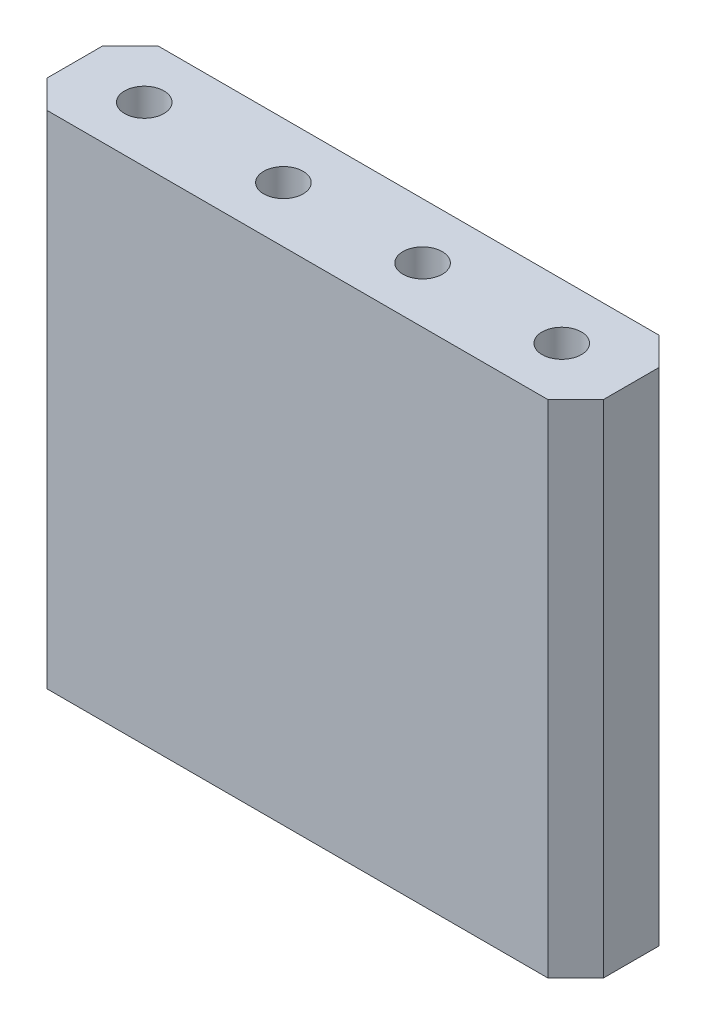
ISO-10303-21;
HEADER;
FILE_DESCRIPTION(('STEP AP214'),'2;1');
FILE_NAME('part.step','',(''),(''),'','','');
FILE_SCHEMA(('AUTOMOTIVE_DESIGN { 1 0 10303 214 1 1 1 1 }'));
ENDSEC;
DATA;
#1=APPLICATION_CONTEXT('core data for automotive mechanical design processes');
#2=APPLICATION_PROTOCOL_DEFINITION('international standard','automotive_design',2000,#1);
#3=PRODUCT_CONTEXT('',#1,'mechanical');
#4=PRODUCT('Part','Part','',(#3));
#5=PRODUCT_RELATED_PRODUCT_CATEGORY('part','',(#4));
#6=PRODUCT_DEFINITION_FORMATION('','',#4);
#7=PRODUCT_DEFINITION_CONTEXT('part definition',#1,'design');
#8=PRODUCT_DEFINITION('design','',#6,#7);
#9=PRODUCT_DEFINITION_SHAPE('','',#8);
#10=(LENGTH_UNIT() NAMED_UNIT(*) SI_UNIT(.MILLI.,.METRE.));
#11=(NAMED_UNIT(*) PLANE_ANGLE_UNIT() SI_UNIT($,.RADIAN.));
#12=(NAMED_UNIT(*) SI_UNIT($,.STERADIAN.) SOLID_ANGLE_UNIT());
#13=UNCERTAINTY_MEASURE_WITH_UNIT(LENGTH_MEASURE(1.E-05),#10,'distance_accuracy_value','');
#14=(GEOMETRIC_REPRESENTATION_CONTEXT(3) GLOBAL_UNCERTAINTY_ASSIGNED_CONTEXT((#13)) GLOBAL_UNIT_ASSIGNED_CONTEXT((#10,
#11,#12)) REPRESENTATION_CONTEXT('',''));
#15=CARTESIAN_POINT('',(0.,0.,0.));
#16=DIRECTION('',(0.,0.,1.));
#17=DIRECTION('',(1.,0.,0.));
#18=AXIS2_PLACEMENT_3D('',#15,#16,#17);
#19=CARTESIAN_POINT('',(0.,7.,0.));
#20=DIRECTION('',(0.,-1.,0.));
#21=DIRECTION('',(0.,0.,-1.));
#22=AXIS2_PLACEMENT_3D('',#19,#20,#21);
#23=PLANE('',#22);
#24=DIRECTION('',(0.,0.,-1.));
#25=VECTOR('',#24,1.);
#26=CARTESIAN_POINT('',(1.5,7.,-0.25));
#27=LINE('',#26,#25);
#28=CARTESIAN_POINT('',(1.5,7.,0.25));
#29=VERTEX_POINT('',#28);
#30=CARTESIAN_POINT('',(1.5,7.,-0.25));
#31=VERTEX_POINT('',#30);
#32=EDGE_CURVE('E212',#29,#31,#27,.T.);
#33=ORIENTED_EDGE('',*,*,#32,.F.);
#34=CARTESIAN_POINT('',(1.25,7.,0.));
#35=DIRECTION('',(0.,1.,0.));
#36=DIRECTION('',(0.,0.,1.));
#37=AXIS2_PLACEMENT_3D('',#34,#35,#36);
#38=CIRCLE('',#37,0.353553390593274);
#39=EDGE_CURVE('E200',#29,#31,#38,.T.);
#40=ORIENTED_EDGE('',*,*,#39,.T.);
#41=EDGE_LOOP('',(#33,#40));
#42=FACE_BOUND('',#41,.T.);
#43=ADVANCED_FACE('F35',(#42),#23,.F.);
#44=DIRECTION('',(-1.,0.,0.));
#45=VECTOR('',#44,1.);
#46=CARTESIAN_POINT('',(0.999999999999999,7.,-0.25));
#47=LINE('',#46,#45);
#48=CARTESIAN_POINT('',(0.999999999999999,7.,-0.25));
#49=VERTEX_POINT('',#48);
#50=EDGE_CURVE('E231',#31,#49,#47,.T.);
#51=ORIENTED_EDGE('',*,*,#50,.F.);
#52=EDGE_CURVE('E197',#31,#49,#38,.T.);
#53=ORIENTED_EDGE('',*,*,#52,.T.);
#54=EDGE_LOOP('',(#51,#53));
#55=FACE_BOUND('',#54,.T.);
#56=ADVANCED_FACE('F236',(#55),#23,.F.);
#57=DIRECTION('',(0.,0.,1.));
#58=VECTOR('',#57,1.);
#59=CARTESIAN_POINT('',(0.999999999999999,7.,-0.25));
#60=LINE('',#59,#58);
#61=CARTESIAN_POINT('',(0.999999999999999,7.,0.25));
#62=VERTEX_POINT('',#61);
#63=EDGE_CURVE('E237',#49,#62,#60,.T.);
#64=ORIENTED_EDGE('',*,*,#63,.F.);
#65=EDGE_CURVE('E203',#49,#62,#38,.T.);
#66=ORIENTED_EDGE('',*,*,#65,.T.);
#67=EDGE_LOOP('',(#64,#66));
#68=FACE_BOUND('',#67,.T.);
#69=ADVANCED_FACE('F482',(#68),#23,.F.);
#70=DIRECTION('',(1.,0.,0.));
#71=VECTOR('',#70,1.);
#72=CARTESIAN_POINT('',(0.999999999999999,7.,0.25));
#73=LINE('',#72,#71);
#74=EDGE_CURVE('E226',#62,#29,#73,.T.);
#75=ORIENTED_EDGE('',*,*,#74,.F.);
#76=EDGE_CURVE('E215',#62,#29,#38,.T.);
#77=ORIENTED_EDGE('',*,*,#76,.T.);
#78=EDGE_LOOP('',(#75,#77));
#79=FACE_BOUND('',#78,.T.);
#80=ADVANCED_FACE('F531',(#79),#23,.F.);
#81=DIRECTION('',(0.,0.,-1.));
#82=VECTOR('',#81,1.);
#83=CARTESIAN_POINT('',(-3.5,7.,-0.25));
#84=LINE('',#83,#82);
#85=CARTESIAN_POINT('',(-3.5,7.,0.25));
#86=VERTEX_POINT('',#85);
#87=CARTESIAN_POINT('',(-3.5,7.,-0.25));
#88=VERTEX_POINT('',#87);
#89=EDGE_CURVE('E298',#86,#88,#84,.T.);
#90=ORIENTED_EDGE('',*,*,#89,.F.);
#91=CARTESIAN_POINT('',(-3.75,7.,0.));
#92=DIRECTION('',(0.,1.,0.));
#93=DIRECTION('',(0.,0.,1.));
#94=AXIS2_PLACEMENT_3D('',#91,#92,#93);
#95=CIRCLE('',#94,0.353553390593274);
#96=EDGE_CURVE('E437',#86,#88,#95,.T.);
#97=ORIENTED_EDGE('',*,*,#96,.T.);
#98=EDGE_LOOP('',(#90,#97));
#99=FACE_BOUND('',#98,.T.);
#100=ADVANCED_FACE('F857',(#99),#23,.F.);
#101=DIRECTION('',(-1.,0.,0.));
#102=VECTOR('',#101,1.);
#103=CARTESIAN_POINT('',(-4.,7.,-0.25));
#104=LINE('',#103,#102);
#105=CARTESIAN_POINT('',(-4.,7.,-0.25));
#106=VERTEX_POINT('',#105);
#107=EDGE_CURVE('E302',#88,#106,#104,.T.);
#108=ORIENTED_EDGE('',*,*,#107,.F.);
#109=EDGE_CURVE('E441',#88,#106,#95,.T.);
#110=ORIENTED_EDGE('',*,*,#109,.T.);
#111=EDGE_LOOP('',(#108,#110));
#112=FACE_BOUND('',#111,.T.);
#113=ADVANCED_FACE('F849',(#112),#23,.F.);
#114=DIRECTION('',(0.,0.,1.));
#115=VECTOR('',#114,1.);
#116=CARTESIAN_POINT('',(-4.,7.,0.25));
#117=LINE('',#116,#115);
#118=CARTESIAN_POINT('',(-4.,7.,0.25));
#119=VERTEX_POINT('',#118);
#120=EDGE_CURVE('E305',#106,#119,#117,.T.);
#121=ORIENTED_EDGE('',*,*,#120,.F.);
#122=EDGE_CURVE('E533',#106,#119,#95,.T.);
#123=ORIENTED_EDGE('',*,*,#122,.T.);
#124=EDGE_LOOP('',(#121,#123));
#125=FACE_BOUND('',#124,.T.);
#126=ADVANCED_FACE('F580',(#125),#23,.F.);
#127=DIRECTION('',(1.,0.,0.));
#128=VECTOR('',#127,1.);
#129=CARTESIAN_POINT('',(-3.5,7.,0.25));
#130=LINE('',#129,#128);
#131=EDGE_CURVE('E295',#119,#86,#130,.T.);
#132=ORIENTED_EDGE('',*,*,#131,.F.);
#133=EDGE_CURVE('E442',#119,#86,#95,.T.);
#134=ORIENTED_EDGE('',*,*,#133,.T.);
#135=EDGE_LOOP('',(#132,#134));
#136=FACE_BOUND('',#135,.T.);
#137=ADVANCED_FACE('F575',(#136),#23,.F.);
#138=DIRECTION('',(0.,0.,-1.));
#139=VECTOR('',#138,1.);
#140=CARTESIAN_POINT('',(-1.,7.,-0.25));
#141=LINE('',#140,#139);
#142=CARTESIAN_POINT('',(-1.,7.,0.25));
#143=VERTEX_POINT('',#142);
#144=CARTESIAN_POINT('',(-1.,7.,-0.25));
#145=VERTEX_POINT('',#144);
#146=EDGE_CURVE('E271',#143,#145,#141,.T.);
#147=ORIENTED_EDGE('',*,*,#146,.F.);
#148=CARTESIAN_POINT('',(-1.25,7.,0.));
#149=DIRECTION('',(0.,1.,0.));
#150=DIRECTION('',(0.,0.,1.));
#151=AXIS2_PLACEMENT_3D('',#148,#149,#150);
#152=CIRCLE('',#151,0.353553390593274);
#153=EDGE_CURVE('E445',#143,#145,#152,.T.);
#154=ORIENTED_EDGE('',*,*,#153,.T.);
#155=EDGE_LOOP('',(#147,#154));
#156=FACE_BOUND('',#155,.T.);
#157=ADVANCED_FACE('F570',(#156),#23,.F.);
#158=DIRECTION('',(-1.,0.,0.));
#159=VECTOR('',#158,1.);
#160=CARTESIAN_POINT('',(-1.5,7.,-0.25));
#161=LINE('',#160,#159);
#162=CARTESIAN_POINT('',(-1.5,7.,-0.25));
#163=VERTEX_POINT('',#162);
#164=EDGE_CURVE('E261',#145,#163,#161,.T.);
#165=ORIENTED_EDGE('',*,*,#164,.F.);
#166=EDGE_CURVE('E448',#145,#163,#152,.T.);
#167=ORIENTED_EDGE('',*,*,#166,.T.);
#168=EDGE_LOOP('',(#165,#167));
#169=FACE_BOUND('',#168,.T.);
#170=ADVANCED_FACE('F568',(#169),#23,.F.);
#171=DIRECTION('',(0.,0.,1.));
#172=VECTOR('',#171,1.);
#173=CARTESIAN_POINT('',(-1.5,7.,-0.25));
#174=LINE('',#173,#172);
#175=CARTESIAN_POINT('',(-1.5,7.,0.25));
#176=VERTEX_POINT('',#175);
#177=EDGE_CURVE('E264',#163,#176,#174,.T.);
#178=ORIENTED_EDGE('',*,*,#177,.F.);
#179=EDGE_CURVE('E516',#163,#176,#152,.T.);
#180=ORIENTED_EDGE('',*,*,#179,.T.);
#181=EDGE_LOOP('',(#178,#180));
#182=FACE_BOUND('',#181,.T.);
#183=ADVANCED_FACE('F549',(#182),#23,.F.);
#184=DIRECTION('',(1.,0.,0.));
#185=VECTOR('',#184,1.);
#186=CARTESIAN_POINT('',(-1.,7.,0.25));
#187=LINE('',#186,#185);
#188=EDGE_CURVE('E268',#176,#143,#187,.T.);
#189=ORIENTED_EDGE('',*,*,#188,.F.);
#190=EDGE_CURVE('E449',#176,#143,#152,.T.);
#191=ORIENTED_EDGE('',*,*,#190,.T.);
#192=EDGE_LOOP('',(#189,#191));
#193=FACE_BOUND('',#192,.T.);
#194=ADVANCED_FACE('F561',(#193),#23,.F.);
#195=DIRECTION('',(0.,0.,-1.));
#196=VECTOR('',#195,1.);
#197=CARTESIAN_POINT('',(4.,7.,0.25));
#198=LINE('',#197,#196);
#199=CARTESIAN_POINT('',(4.,7.,0.25));
#200=VERTEX_POINT('',#199);
#201=CARTESIAN_POINT('',(4.,7.,-0.25));
#202=VERTEX_POINT('',#201);
#203=EDGE_CURVE('E339',#200,#202,#198,.T.);
#204=ORIENTED_EDGE('',*,*,#203,.F.);
#205=CARTESIAN_POINT('',(3.75,7.,0.));
#206=DIRECTION('',(0.,1.,0.));
#207=DIRECTION('',(0.,0.,1.));
#208=AXIS2_PLACEMENT_3D('',#205,#206,#207);
#209=CIRCLE('',#208,0.353553390593274);
#210=EDGE_CURVE('E454',#200,#202,#209,.T.);
#211=ORIENTED_EDGE('',*,*,#210,.T.);
#212=EDGE_LOOP('',(#204,#211));
#213=FACE_BOUND('',#212,.T.);
#214=ADVANCED_FACE('F504',(#213),#23,.F.);
#215=DIRECTION('',(-1.,0.,0.));
#216=VECTOR('',#215,1.);
#217=CARTESIAN_POINT('',(3.5,7.,-0.25));
#218=LINE('',#217,#216);
#219=CARTESIAN_POINT('',(3.5,7.,-0.25));
#220=VERTEX_POINT('',#219);
#221=EDGE_CURVE('E329',#202,#220,#218,.T.);
#222=ORIENTED_EDGE('',*,*,#221,.F.);
#223=EDGE_CURVE('E457',#202,#220,#209,.T.);
#224=ORIENTED_EDGE('',*,*,#223,.T.);
#225=EDGE_LOOP('',(#222,#224));
#226=FACE_BOUND('',#225,.T.);
#227=ADVANCED_FACE('F492',(#226),#23,.F.);
#228=DIRECTION('',(0.,0.,1.));
#229=VECTOR('',#228,1.);
#230=CARTESIAN_POINT('',(3.5,7.,-0.25));
#231=LINE('',#230,#229);
#232=CARTESIAN_POINT('',(3.5,7.,0.25));
#233=VERTEX_POINT('',#232);
#234=EDGE_CURVE('E332',#220,#233,#231,.T.);
#235=ORIENTED_EDGE('',*,*,#234,.F.);
#236=EDGE_CURVE('E514',#220,#233,#209,.T.);
#237=ORIENTED_EDGE('',*,*,#236,.T.);
#238=EDGE_LOOP('',(#235,#237));
#239=FACE_BOUND('',#238,.T.);
#240=ADVANCED_FACE('F486',(#239),#23,.F.);
#241=DIRECTION('',(1.,0.,0.));
#242=VECTOR('',#241,1.);
#243=CARTESIAN_POINT('',(3.5,7.,0.25));
#244=LINE('',#243,#242);
#245=EDGE_CURVE('E336',#233,#200,#244,.T.);
#246=ORIENTED_EDGE('',*,*,#245,.F.);
#247=EDGE_CURVE('E373',#233,#200,#209,.T.);
#248=ORIENTED_EDGE('',*,*,#247,.T.);
#249=EDGE_LOOP('',(#246,#248));
#250=FACE_BOUND('',#249,.T.);
#251=ADVANCED_FACE('F478',(#250),#23,.F.);
#252=CARTESIAN_POINT('',(0.,0.,0.));
#253=DIRECTION('',(0.,-1.,0.));
#254=DIRECTION('',(0.,0.,-1.));
#255=AXIS2_PLACEMENT_3D('',#252,#253,#254);
#256=PLANE('',#255);
#257=DIRECTION('',(1.,0.,0.));
#258=VECTOR('',#257,1.);
#259=CARTESIAN_POINT('',(-5.,0.,1.));
#260=LINE('',#259,#258);
#261=CARTESIAN_POINT('',(-4.5,0.,1.));
#262=VERTEX_POINT('',#261);
#263=CARTESIAN_POINT('',(4.5,0.,1.));
#264=VERTEX_POINT('',#263);
#265=EDGE_CURVE('E370',#262,#264,#260,.T.);
#266=ORIENTED_EDGE('',*,*,#265,.F.);
#267=DIRECTION('',(0.707106781186546,0.,0.707106781186549));
#268=VECTOR('',#267,1.);
#269=CARTESIAN_POINT('',(-2.75000000000001,0.,2.75));
#270=LINE('',#269,#268);
#271=CARTESIAN_POINT('',(-5.,0.,0.499999999999999));
#272=VERTEX_POINT('',#271);
#273=EDGE_CURVE('E384',#262,#272,#270,.F.);
#274=ORIENTED_EDGE('',*,*,#273,.T.);
#275=DIRECTION('',(0.,0.,1.));
#276=VECTOR('',#275,1.);
#277=CARTESIAN_POINT('',(-5.,0.,1.));
#278=LINE('',#277,#276);
#279=CARTESIAN_POINT('',(-5.,0.,-0.5));
#280=VERTEX_POINT('',#279);
#281=EDGE_CURVE('E367',#280,#272,#278,.T.);
#282=ORIENTED_EDGE('',*,*,#281,.F.);
#283=DIRECTION('',(-0.707106781186549,0.,0.707106781186546));
#284=VECTOR('',#283,1.);
#285=CARTESIAN_POINT('',(-2.74999999999999,0.,-2.75));
#286=LINE('',#285,#284);
#287=CARTESIAN_POINT('',(-4.5,0.,-1.));
#288=VERTEX_POINT('',#287);
#289=EDGE_CURVE('E382',#280,#288,#286,.F.);
#290=ORIENTED_EDGE('',*,*,#289,.T.);
#291=DIRECTION('',(-1.,0.,0.));
#292=VECTOR('',#291,1.);
#293=CARTESIAN_POINT('',(-5.,0.,-1.));
#294=LINE('',#293,#292);
#295=CARTESIAN_POINT('',(4.5,0.,-1.));
#296=VERTEX_POINT('',#295);
#297=EDGE_CURVE('E365',#296,#288,#294,.T.);
#298=ORIENTED_EDGE('',*,*,#297,.F.);
#299=DIRECTION('',(-0.707106781186546,0.,-0.707106781186549));
#300=VECTOR('',#299,1.);
#301=CARTESIAN_POINT('',(2.75000000000001,0.,-2.75));
#302=LINE('',#301,#300);
#303=CARTESIAN_POINT('',(5.,0.,-0.499999999999998));
#304=VERTEX_POINT('',#303);
#305=EDGE_CURVE('E378',#296,#304,#302,.F.);
#306=ORIENTED_EDGE('',*,*,#305,.T.);
#307=DIRECTION('',(0.,0.,-1.));
#308=VECTOR('',#307,1.);
#309=CARTESIAN_POINT('',(5.,0.,1.));
#310=LINE('',#309,#308);
#311=CARTESIAN_POINT('',(5.,0.,0.499999999999999));
#312=VERTEX_POINT('',#311);
#313=EDGE_CURVE('E362',#312,#304,#310,.T.);
#314=ORIENTED_EDGE('',*,*,#313,.F.);
#315=DIRECTION('',(0.707106781186549,0.,-0.707106781186546));
#316=VECTOR('',#315,1.);
#317=CARTESIAN_POINT('',(2.74999999999999,0.,2.75));
#318=LINE('',#317,#316);
#319=EDGE_CURVE('E380',#312,#264,#318,.F.);
#320=ORIENTED_EDGE('',*,*,#319,.T.);
#321=EDGE_LOOP('',(#266,#274,#282,#290,#298,#306,#314,#320));
#322=FACE_BOUND('',#321,.T.);
#323=DIRECTION('',(0.,0.,-1.));
#324=VECTOR('',#323,1.);
#325=CARTESIAN_POINT('',(4.,0.,0.25));
#326=LINE('',#325,#324);
#327=CARTESIAN_POINT('',(4.,0.,0.25));
#328=VERTEX_POINT('',#327);
#329=CARTESIAN_POINT('',(4.,0.,-0.25));
#330=VERTEX_POINT('',#329);
#331=EDGE_CURVE('E333',#328,#330,#326,.T.);
#332=ORIENTED_EDGE('',*,*,#331,.T.);
#333=DIRECTION('',(-1.,0.,0.));
#334=VECTOR('',#333,1.);
#335=CARTESIAN_POINT('',(3.5,0.,-0.25));
#336=LINE('',#335,#334);
#337=CARTESIAN_POINT('',(3.5,0.,-0.25));
#338=VERTEX_POINT('',#337);
#339=EDGE_CURVE('E328',#330,#338,#336,.T.);
#340=ORIENTED_EDGE('',*,*,#339,.T.);
#341=DIRECTION('',(0.,0.,1.));
#342=VECTOR('',#341,1.);
#343=CARTESIAN_POINT('',(3.5,0.,-0.25));
#344=LINE('',#343,#342);
#345=CARTESIAN_POINT('',(3.5,0.,0.25));
#346=VERTEX_POINT('',#345);
#347=EDGE_CURVE('E345',#338,#346,#344,.T.);
#348=ORIENTED_EDGE('',*,*,#347,.T.);
#349=DIRECTION('',(1.,0.,0.));
#350=VECTOR('',#349,1.);
#351=CARTESIAN_POINT('',(3.5,0.,0.25));
#352=LINE('',#351,#350);
#353=EDGE_CURVE('E348',#346,#328,#352,.T.);
#354=ORIENTED_EDGE('',*,*,#353,.T.);
#355=EDGE_LOOP('',(#332,#340,#348,#354));
#356=FACE_BOUND('',#355,.T.);
#357=DIRECTION('',(0.,0.,1.));
#358=VECTOR('',#357,1.);
#359=CARTESIAN_POINT('',(-4.,0.,0.25));
#360=LINE('',#359,#358);
#361=CARTESIAN_POINT('',(-4.,0.,-0.25));
#362=VERTEX_POINT('',#361);
#363=CARTESIAN_POINT('',(-4.,0.,0.25));
#364=VERTEX_POINT('',#363);
#365=EDGE_CURVE('E299',#362,#364,#360,.T.);
#366=ORIENTED_EDGE('',*,*,#365,.T.);
#367=DIRECTION('',(1.,0.,0.));
#368=VECTOR('',#367,1.);
#369=CARTESIAN_POINT('',(-3.5,0.,0.25));
#370=LINE('',#369,#368);
#371=CARTESIAN_POINT('',(-3.5,0.,0.25));
#372=VERTEX_POINT('',#371);
#373=EDGE_CURVE('E294',#364,#372,#370,.T.);
#374=ORIENTED_EDGE('',*,*,#373,.T.);
#375=DIRECTION('',(0.,0.,-1.));
#376=VECTOR('',#375,1.);
#377=CARTESIAN_POINT('',(-3.5,0.,-0.25));
#378=LINE('',#377,#376);
#379=CARTESIAN_POINT('',(-3.5,0.,-0.25));
#380=VERTEX_POINT('',#379);
#381=EDGE_CURVE('E311',#372,#380,#378,.T.);
#382=ORIENTED_EDGE('',*,*,#381,.T.);
#383=DIRECTION('',(-1.,0.,0.));
#384=VECTOR('',#383,1.);
#385=CARTESIAN_POINT('',(-4.,0.,-0.25));
#386=LINE('',#385,#384);
#387=EDGE_CURVE('E314',#380,#362,#386,.T.);
#388=ORIENTED_EDGE('',*,*,#387,.T.);
#389=EDGE_LOOP('',(#366,#374,#382,#388));
#390=FACE_BOUND('',#389,.T.);
#391=DIRECTION('',(0.,0.,-1.));
#392=VECTOR('',#391,1.);
#393=CARTESIAN_POINT('',(-1.,0.,-0.25));
#394=LINE('',#393,#392);
#395=CARTESIAN_POINT('',(-1.,0.,0.25));
#396=VERTEX_POINT('',#395);
#397=CARTESIAN_POINT('',(-1.,0.,-0.25));
#398=VERTEX_POINT('',#397);
#399=EDGE_CURVE('E265',#396,#398,#394,.T.);
#400=ORIENTED_EDGE('',*,*,#399,.T.);
#401=DIRECTION('',(-1.,0.,0.));
#402=VECTOR('',#401,1.);
#403=CARTESIAN_POINT('',(-1.5,0.,-0.25));
#404=LINE('',#403,#402);
#405=CARTESIAN_POINT('',(-1.5,0.,-0.25));
#406=VERTEX_POINT('',#405);
#407=EDGE_CURVE('E260',#398,#406,#404,.T.);
#408=ORIENTED_EDGE('',*,*,#407,.T.);
#409=DIRECTION('',(0.,0.,1.));
#410=VECTOR('',#409,1.);
#411=CARTESIAN_POINT('',(-1.5,0.,-0.25));
#412=LINE('',#411,#410);
#413=CARTESIAN_POINT('',(-1.5,0.,0.25));
#414=VERTEX_POINT('',#413);
#415=EDGE_CURVE('E277',#406,#414,#412,.T.);
#416=ORIENTED_EDGE('',*,*,#415,.T.);
#417=DIRECTION('',(1.,0.,0.));
#418=VECTOR('',#417,1.);
#419=CARTESIAN_POINT('',(-1.,0.,0.25));
#420=LINE('',#419,#418);
#421=EDGE_CURVE('E280',#414,#396,#420,.T.);
#422=ORIENTED_EDGE('',*,*,#421,.T.);
#423=EDGE_LOOP('',(#400,#408,#416,#422));
#424=FACE_BOUND('',#423,.T.);
#425=DIRECTION('',(0.,0.,-1.));
#426=VECTOR('',#425,1.);
#427=CARTESIAN_POINT('',(1.5,0.,-0.25));
#428=LINE('',#427,#426);
#429=CARTESIAN_POINT('',(1.5,0.,0.25));
#430=VERTEX_POINT('',#429);
#431=CARTESIAN_POINT('',(1.5,0.,-0.25));
#432=VERTEX_POINT('',#431);
#433=EDGE_CURVE('E238',#430,#432,#428,.T.);
#434=ORIENTED_EDGE('',*,*,#433,.T.);
#435=DIRECTION('',(-1.,0.,0.));
#436=VECTOR('',#435,1.);
#437=CARTESIAN_POINT('',(0.999999999999999,0.,-0.25));
#438=LINE('',#437,#436);
#439=CARTESIAN_POINT('',(0.999999999999999,0.,-0.25));
#440=VERTEX_POINT('',#439);
#441=EDGE_CURVE('E234',#432,#440,#438,.T.);
#442=ORIENTED_EDGE('',*,*,#441,.T.);
#443=DIRECTION('',(0.,0.,1.));
#444=VECTOR('',#443,1.);
#445=CARTESIAN_POINT('',(0.999999999999999,0.,-0.25));
#446=LINE('',#445,#444);
#447=CARTESIAN_POINT('',(0.999999999999999,0.,0.25));
#448=VERTEX_POINT('',#447);
#449=EDGE_CURVE('E250',#440,#448,#446,.T.);
#450=ORIENTED_EDGE('',*,*,#449,.T.);
#451=DIRECTION('',(1.,0.,0.));
#452=VECTOR('',#451,1.);
#453=CARTESIAN_POINT('',(0.999999999999999,0.,0.25));
#454=LINE('',#453,#452);
#455=EDGE_CURVE('E242',#448,#430,#454,.T.);
#456=ORIENTED_EDGE('',*,*,#455,.T.);
#457=EDGE_LOOP('',(#434,#442,#450,#456));
#458=FACE_BOUND('',#457,.T.);
#459=ADVANCED_FACE('F422',(#322,#356,#390,#424,#458),#256,.T.);
#460=CARTESIAN_POINT('',(5.,7.,1.));
#461=DIRECTION('',(-1.,0.,0.));
#462=DIRECTION('',(0.,0.,1.));
#463=AXIS2_PLACEMENT_3D('',#460,#461,#462);
#464=PLANE('',#463);
#465=DIRECTION('',(0.,0.,-1.));
#466=VECTOR('',#465,1.);
#467=CARTESIAN_POINT('',(5.,9.,1.));
#468=LINE('',#467,#466);
#469=CARTESIAN_POINT('',(5.,9.,0.499999999999999));
#470=VERTEX_POINT('',#469);
#471=CARTESIAN_POINT('',(5.,9.,-0.499999999999998));
#472=VERTEX_POINT('',#471);
#473=EDGE_CURVE('E405',#470,#472,#468,.T.);
#474=ORIENTED_EDGE('',*,*,#473,.F.);
#475=DIRECTION('',(0.,-1.,0.));
#476=VECTOR('',#475,1.);
#477=CARTESIAN_POINT('',(5.,7.,0.499999999999999));
#478=LINE('',#477,#476);
#479=EDGE_CURVE('E11',#470,#312,#478,.T.);
#480=ORIENTED_EDGE('',*,*,#479,.T.);
#481=ORIENTED_EDGE('',*,*,#313,.T.);
#482=DIRECTION('',(0.,1.,0.));
#483=VECTOR('',#482,1.);
#484=CARTESIAN_POINT('',(5.,7.,-0.499999999999998));
#485=LINE('',#484,#483);
#486=EDGE_CURVE('E43',#304,#472,#485,.T.);
#487=ORIENTED_EDGE('',*,*,#486,.T.);
#488=EDGE_LOOP('',(#474,#480,#481,#487));
#489=FACE_BOUND('',#488,.T.);
#490=ADVANCED_FACE('F404',(#489),#464,.F.);
#491=CARTESIAN_POINT('',(-5.,7.,-1.));
#492=DIRECTION('',(0.,0.,1.));
#493=DIRECTION('',(1.,0.,0.));
#494=AXIS2_PLACEMENT_3D('',#491,#492,#493);
#495=PLANE('',#494);
#496=ORIENTED_EDGE('',*,*,#297,.T.);
#497=DIRECTION('',(0.,1.,0.));
#498=VECTOR('',#497,1.);
#499=CARTESIAN_POINT('',(-4.5,7.,-1.));
#500=LINE('',#499,#498);
#501=CARTESIAN_POINT('',(-4.5,9.,-1.));
#502=VERTEX_POINT('',#501);
#503=EDGE_CURVE('E50',#288,#502,#500,.T.);
#504=ORIENTED_EDGE('',*,*,#503,.T.);
#505=DIRECTION('',(-1.,0.,0.));
#506=VECTOR('',#505,1.);
#507=CARTESIAN_POINT('',(-5.,9.,-1.));
#508=LINE('',#507,#506);
#509=CARTESIAN_POINT('',(4.5,9.,-1.));
#510=VERTEX_POINT('',#509);
#511=EDGE_CURVE('E414',#510,#502,#508,.T.);
#512=ORIENTED_EDGE('',*,*,#511,.F.);
#513=DIRECTION('',(0.,-1.,0.));
#514=VECTOR('',#513,1.);
#515=CARTESIAN_POINT('',(4.5,7.,-1.));
#516=LINE('',#515,#514);
#517=EDGE_CURVE('E398',#510,#296,#516,.T.);
#518=ORIENTED_EDGE('',*,*,#517,.T.);
#519=EDGE_LOOP('',(#496,#504,#512,#518));
#520=FACE_BOUND('',#519,.T.);
#521=ADVANCED_FACE('F419',(#520),#495,.F.);
#522=CARTESIAN_POINT('',(-5.,7.,1.));
#523=DIRECTION('',(1.,0.,0.));
#524=DIRECTION('',(0.,0.,-1.));
#525=AXIS2_PLACEMENT_3D('',#522,#523,#524);
#526=PLANE('',#525);
#527=ORIENTED_EDGE('',*,*,#281,.T.);
#528=DIRECTION('',(0.,1.,0.));
#529=VECTOR('',#528,1.);
#530=CARTESIAN_POINT('',(-5.,7.,0.499999999999999));
#531=LINE('',#530,#529);
#532=CARTESIAN_POINT('',(-5.,9.,0.499999999999999));
#533=VERTEX_POINT('',#532);
#534=EDGE_CURVE('E389',#272,#533,#531,.T.);
#535=ORIENTED_EDGE('',*,*,#534,.T.);
#536=DIRECTION('',(0.,0.,1.));
#537=VECTOR('',#536,1.);
#538=CARTESIAN_POINT('',(-5.,9.,1.));
#539=LINE('',#538,#537);
#540=CARTESIAN_POINT('',(-5.,9.,-0.5));
#541=VERTEX_POINT('',#540);
#542=EDGE_CURVE('E433',#541,#533,#539,.T.);
#543=ORIENTED_EDGE('',*,*,#542,.F.);
#544=DIRECTION('',(0.,-1.,0.));
#545=VECTOR('',#544,1.);
#546=CARTESIAN_POINT('',(-5.,7.,-0.5));
#547=LINE('',#546,#545);
#548=EDGE_CURVE('E386',#541,#280,#547,.T.);
#549=ORIENTED_EDGE('',*,*,#548,.T.);
#550=EDGE_LOOP('',(#527,#535,#543,#549));
#551=FACE_BOUND('',#550,.T.);
#552=ADVANCED_FACE('F431',(#551),#526,.F.);
#553=CARTESIAN_POINT('',(-5.,7.,1.));
#554=DIRECTION('',(0.,0.,-1.));
#555=DIRECTION('',(-1.,0.,0.));
#556=AXIS2_PLACEMENT_3D('',#553,#554,#555);
#557=PLANE('',#556);
#558=DIRECTION('',(1.,0.,0.));
#559=VECTOR('',#558,1.);
#560=CARTESIAN_POINT('',(-5.,9.,1.));
#561=LINE('',#560,#559);
#562=CARTESIAN_POINT('',(-4.5,9.,1.));
#563=VERTEX_POINT('',#562);
#564=CARTESIAN_POINT('',(4.5,9.,1.));
#565=VERTEX_POINT('',#564);
#566=EDGE_CURVE('E245',#563,#565,#561,.T.);
#567=ORIENTED_EDGE('',*,*,#566,.F.);
#568=DIRECTION('',(0.,-1.,0.));
#569=VECTOR('',#568,1.);
#570=CARTESIAN_POINT('',(-4.5,7.,1.));
#571=LINE('',#570,#569);
#572=EDGE_CURVE('E375',#563,#262,#571,.T.);
#573=ORIENTED_EDGE('',*,*,#572,.T.);
#574=ORIENTED_EDGE('',*,*,#265,.T.);
#575=DIRECTION('',(0.,1.,0.));
#576=VECTOR('',#575,1.);
#577=CARTESIAN_POINT('',(4.5,7.,1.));
#578=LINE('',#577,#576);
#579=EDGE_CURVE('E207',#264,#565,#578,.T.);
#580=ORIENTED_EDGE('',*,*,#579,.T.);
#581=EDGE_LOOP('',(#567,#573,#574,#580));
#582=FACE_BOUND('',#581,.T.);
#583=ADVANCED_FACE('F612',(#582),#557,.F.);
#584=CARTESIAN_POINT('',(3.5,7.,-0.25));
#585=DIRECTION('',(0.,0.,1.));
#586=DIRECTION('',(1.,0.,0.));
#587=AXIS2_PLACEMENT_3D('',#584,#585,#586);
#588=PLANE('',#587);
#589=ORIENTED_EDGE('',*,*,#339,.F.);
#590=DIRECTION('',(0.,-1.,0.));
#591=VECTOR('',#590,1.);
#592=CARTESIAN_POINT('',(4.,7.,-0.25));
#593=LINE('',#592,#591);
#594=EDGE_CURVE('E342',#202,#330,#593,.T.);
#595=ORIENTED_EDGE('',*,*,#594,.F.);
#596=ORIENTED_EDGE('',*,*,#221,.T.);
#597=DIRECTION('',(0.,-1.,0.));
#598=VECTOR('',#597,1.);
#599=CARTESIAN_POINT('',(3.5,7.,-0.25));
#600=LINE('',#599,#598);
#601=EDGE_CURVE('E359',#220,#338,#600,.T.);
#602=ORIENTED_EDGE('',*,*,#601,.T.);
#603=EDGE_LOOP('',(#589,#595,#596,#602));
#604=FACE_BOUND('',#603,.T.);
#605=ADVANCED_FACE('F510',(#604),#588,.T.);
#606=CARTESIAN_POINT('',(3.5,7.,-0.25));
#607=DIRECTION('',(1.,0.,0.));
#608=DIRECTION('',(0.,0.,-1.));
#609=AXIS2_PLACEMENT_3D('',#606,#607,#608);
#610=PLANE('',#609);
#611=ORIENTED_EDGE('',*,*,#347,.F.);
#612=ORIENTED_EDGE('',*,*,#601,.F.);
#613=ORIENTED_EDGE('',*,*,#234,.T.);
#614=DIRECTION('',(0.,-1.,0.));
#615=VECTOR('',#614,1.);
#616=CARTESIAN_POINT('',(3.5,7.,0.25));
#617=LINE('',#616,#615);
#618=EDGE_CURVE('E357',#233,#346,#617,.T.);
#619=ORIENTED_EDGE('',*,*,#618,.T.);
#620=EDGE_LOOP('',(#611,#612,#613,#619));
#621=FACE_BOUND('',#620,.T.);
#622=ADVANCED_FACE('F520',(#621),#610,.T.);
#623=CARTESIAN_POINT('',(3.5,7.,0.25));
#624=DIRECTION('',(0.,0.,-1.));
#625=DIRECTION('',(-1.,0.,0.));
#626=AXIS2_PLACEMENT_3D('',#623,#624,#625);
#627=PLANE('',#626);
#628=ORIENTED_EDGE('',*,*,#353,.F.);
#629=ORIENTED_EDGE('',*,*,#618,.F.);
#630=ORIENTED_EDGE('',*,*,#245,.T.);
#631=DIRECTION('',(0.,-1.,0.));
#632=VECTOR('',#631,1.);
#633=CARTESIAN_POINT('',(4.,7.,0.25));
#634=LINE('',#633,#632);
#635=EDGE_CURVE('E355',#200,#328,#634,.T.);
#636=ORIENTED_EDGE('',*,*,#635,.T.);
#637=EDGE_LOOP('',(#628,#629,#630,#636));
#638=FACE_BOUND('',#637,.T.);
#639=ADVANCED_FACE('F501',(#638),#627,.T.);
#640=CARTESIAN_POINT('',(4.,7.,0.25));
#641=DIRECTION('',(-1.,0.,0.));
#642=DIRECTION('',(0.,0.,1.));
#643=AXIS2_PLACEMENT_3D('',#640,#641,#642);
#644=PLANE('',#643);
#645=ORIENTED_EDGE('',*,*,#331,.F.);
#646=ORIENTED_EDGE('',*,*,#635,.F.);
#647=ORIENTED_EDGE('',*,*,#203,.T.);
#648=ORIENTED_EDGE('',*,*,#594,.T.);
#649=EDGE_LOOP('',(#645,#646,#647,#648));
#650=FACE_BOUND('',#649,.T.);
#651=ADVANCED_FACE('F507',(#650),#644,.T.);
#652=CARTESIAN_POINT('',(-3.5,7.,0.25));
#653=DIRECTION('',(0.,0.,-1.));
#654=DIRECTION('',(-1.,0.,0.));
#655=AXIS2_PLACEMENT_3D('',#652,#653,#654);
#656=PLANE('',#655);
#657=ORIENTED_EDGE('',*,*,#373,.F.);
#658=DIRECTION('',(0.,-1.,0.));
#659=VECTOR('',#658,1.);
#660=CARTESIAN_POINT('',(-4.,7.,0.25));
#661=LINE('',#660,#659);
#662=EDGE_CURVE('E308',#119,#364,#661,.T.);
#663=ORIENTED_EDGE('',*,*,#662,.F.);
#664=ORIENTED_EDGE('',*,*,#131,.T.);
#665=DIRECTION('',(0.,-1.,0.));
#666=VECTOR('',#665,1.);
#667=CARTESIAN_POINT('',(-3.5,7.,0.25));
#668=LINE('',#667,#666);
#669=EDGE_CURVE('E325',#86,#372,#668,.T.);
#670=ORIENTED_EDGE('',*,*,#669,.T.);
#671=EDGE_LOOP('',(#657,#663,#664,#670));
#672=FACE_BOUND('',#671,.T.);
#673=ADVANCED_FACE('F749',(#672),#656,.T.);
#674=CARTESIAN_POINT('',(-3.5,7.,-0.25));
#675=DIRECTION('',(-1.,0.,0.));
#676=DIRECTION('',(0.,0.,1.));
#677=AXIS2_PLACEMENT_3D('',#674,#675,#676);
#678=PLANE('',#677);
#679=ORIENTED_EDGE('',*,*,#381,.F.);
#680=ORIENTED_EDGE('',*,*,#669,.F.);
#681=ORIENTED_EDGE('',*,*,#89,.T.);
#682=DIRECTION('',(0.,-1.,0.));
#683=VECTOR('',#682,1.);
#684=CARTESIAN_POINT('',(-3.5,7.,-0.25));
#685=LINE('',#684,#683);
#686=EDGE_CURVE('E323',#88,#380,#685,.T.);
#687=ORIENTED_EDGE('',*,*,#686,.T.);
#688=EDGE_LOOP('',(#679,#680,#681,#687));
#689=FACE_BOUND('',#688,.T.);
#690=ADVANCED_FACE('F739',(#689),#678,.T.);
#691=CARTESIAN_POINT('',(-4.,7.,-0.25));
#692=DIRECTION('',(0.,0.,1.));
#693=DIRECTION('',(1.,0.,0.));
#694=AXIS2_PLACEMENT_3D('',#691,#692,#693);
#695=PLANE('',#694);
#696=ORIENTED_EDGE('',*,*,#387,.F.);
#697=ORIENTED_EDGE('',*,*,#686,.F.);
#698=ORIENTED_EDGE('',*,*,#107,.T.);
#699=DIRECTION('',(0.,-1.,0.));
#700=VECTOR('',#699,1.);
#701=CARTESIAN_POINT('',(-4.,7.,-0.25));
#702=LINE('',#701,#700);
#703=EDGE_CURVE('E321',#106,#362,#702,.T.);
#704=ORIENTED_EDGE('',*,*,#703,.T.);
#705=EDGE_LOOP('',(#696,#697,#698,#704));
#706=FACE_BOUND('',#705,.T.);
#707=ADVANCED_FACE('F729',(#706),#695,.T.);
#708=CARTESIAN_POINT('',(-4.,7.,0.25));
#709=DIRECTION('',(1.,0.,0.));
#710=DIRECTION('',(0.,0.,-1.));
#711=AXIS2_PLACEMENT_3D('',#708,#709,#710);
#712=PLANE('',#711);
#713=ORIENTED_EDGE('',*,*,#365,.F.);
#714=ORIENTED_EDGE('',*,*,#703,.F.);
#715=ORIENTED_EDGE('',*,*,#120,.T.);
#716=ORIENTED_EDGE('',*,*,#662,.T.);
#717=EDGE_LOOP('',(#713,#714,#715,#716));
#718=FACE_BOUND('',#717,.T.);
#719=ADVANCED_FACE('F720',(#718),#712,.T.);
#720=CARTESIAN_POINT('',(-1.5,7.,-0.25));
#721=DIRECTION('',(0.,0.,1.));
#722=DIRECTION('',(1.,0.,0.));
#723=AXIS2_PLACEMENT_3D('',#720,#721,#722);
#724=PLANE('',#723);
#725=ORIENTED_EDGE('',*,*,#407,.F.);
#726=DIRECTION('',(0.,-1.,0.));
#727=VECTOR('',#726,1.);
#728=CARTESIAN_POINT('',(-1.,7.,-0.25));
#729=LINE('',#728,#727);
#730=EDGE_CURVE('E274',#145,#398,#729,.T.);
#731=ORIENTED_EDGE('',*,*,#730,.F.);
#732=ORIENTED_EDGE('',*,*,#164,.T.);
#733=DIRECTION('',(0.,-1.,0.));
#734=VECTOR('',#733,1.);
#735=CARTESIAN_POINT('',(-1.5,7.,-0.25));
#736=LINE('',#735,#734);
#737=EDGE_CURVE('E291',#163,#406,#736,.T.);
#738=ORIENTED_EDGE('',*,*,#737,.T.);
#739=EDGE_LOOP('',(#725,#731,#732,#738));
#740=FACE_BOUND('',#739,.T.);
#741=ADVANCED_FACE('F567',(#740),#724,.T.);
#742=CARTESIAN_POINT('',(-1.5,7.,-0.25));
#743=DIRECTION('',(1.,0.,0.));
#744=DIRECTION('',(0.,0.,-1.));
#745=AXIS2_PLACEMENT_3D('',#742,#743,#744);
#746=PLANE('',#745);
#747=ORIENTED_EDGE('',*,*,#415,.F.);
#748=ORIENTED_EDGE('',*,*,#737,.F.);
#749=ORIENTED_EDGE('',*,*,#177,.T.);
#750=DIRECTION('',(0.,-1.,0.));
#751=VECTOR('',#750,1.);
#752=CARTESIAN_POINT('',(-1.5,7.,0.25));
#753=LINE('',#752,#751);
#754=EDGE_CURVE('E289',#176,#414,#753,.T.);
#755=ORIENTED_EDGE('',*,*,#754,.T.);
#756=EDGE_LOOP('',(#747,#748,#749,#755));
#757=FACE_BOUND('',#756,.T.);
#758=ADVANCED_FACE('F554',(#757),#746,.T.);
#759=CARTESIAN_POINT('',(-1.,7.,0.25));
#760=DIRECTION('',(0.,0.,-1.));
#761=DIRECTION('',(-1.,0.,0.));
#762=AXIS2_PLACEMENT_3D('',#759,#760,#761);
#763=PLANE('',#762);
#764=ORIENTED_EDGE('',*,*,#421,.F.);
#765=ORIENTED_EDGE('',*,*,#754,.F.);
#766=ORIENTED_EDGE('',*,*,#188,.T.);
#767=DIRECTION('',(0.,-1.,0.));
#768=VECTOR('',#767,1.);
#769=CARTESIAN_POINT('',(-1.,7.,0.25));
#770=LINE('',#769,#768);
#771=EDGE_CURVE('E287',#143,#396,#770,.T.);
#772=ORIENTED_EDGE('',*,*,#771,.T.);
#773=EDGE_LOOP('',(#764,#765,#766,#772));
#774=FACE_BOUND('',#773,.T.);
#775=ADVANCED_FACE('F558',(#774),#763,.T.);
#776=CARTESIAN_POINT('',(-1.,7.,-0.25));
#777=DIRECTION('',(-1.,0.,0.));
#778=DIRECTION('',(0.,0.,1.));
#779=AXIS2_PLACEMENT_3D('',#776,#777,#778);
#780=PLANE('',#779);
#781=ORIENTED_EDGE('',*,*,#399,.F.);
#782=ORIENTED_EDGE('',*,*,#771,.F.);
#783=ORIENTED_EDGE('',*,*,#146,.T.);
#784=ORIENTED_EDGE('',*,*,#730,.T.);
#785=EDGE_LOOP('',(#781,#782,#783,#784));
#786=FACE_BOUND('',#785,.T.);
#787=ADVANCED_FACE('F564',(#786),#780,.T.);
#788=CARTESIAN_POINT('',(0.999999999999999,7.,-0.25));
#789=DIRECTION('',(0.,0.,1.));
#790=DIRECTION('',(1.,0.,0.));
#791=AXIS2_PLACEMENT_3D('',#788,#789,#790);
#792=PLANE('',#791);
#793=ORIENTED_EDGE('',*,*,#441,.F.);
#794=DIRECTION('',(0.,-1.,0.));
#795=VECTOR('',#794,1.);
#796=CARTESIAN_POINT('',(1.5,7.,-0.25));
#797=LINE('',#796,#795);
#798=EDGE_CURVE('E222',#31,#432,#797,.T.);
#799=ORIENTED_EDGE('',*,*,#798,.F.);
#800=ORIENTED_EDGE('',*,*,#50,.T.);
#801=DIRECTION('',(0.,-1.,0.));
#802=VECTOR('',#801,1.);
#803=CARTESIAN_POINT('',(0.999999999999999,7.,-0.25));
#804=LINE('',#803,#802);
#805=EDGE_CURVE('E258',#49,#440,#804,.T.);
#806=ORIENTED_EDGE('',*,*,#805,.T.);
#807=EDGE_LOOP('',(#793,#799,#800,#806));
#808=FACE_BOUND('',#807,.T.);
#809=ADVANCED_FACE('F229',(#808),#792,.T.);
#810=CARTESIAN_POINT('',(0.999999999999999,7.,-0.25));
#811=DIRECTION('',(1.,0.,0.));
#812=DIRECTION('',(0.,0.,-1.));
#813=AXIS2_PLACEMENT_3D('',#810,#811,#812);
#814=PLANE('',#813);
#815=ORIENTED_EDGE('',*,*,#449,.F.);
#816=ORIENTED_EDGE('',*,*,#805,.F.);
#817=ORIENTED_EDGE('',*,*,#63,.T.);
#818=DIRECTION('',(0.,-1.,0.));
#819=VECTOR('',#818,1.);
#820=CARTESIAN_POINT('',(0.999999999999999,7.,0.25));
#821=LINE('',#820,#819);
#822=EDGE_CURVE('E256',#62,#448,#821,.T.);
#823=ORIENTED_EDGE('',*,*,#822,.T.);
#824=EDGE_LOOP('',(#815,#816,#817,#823));
#825=FACE_BOUND('',#824,.T.);
#826=ADVANCED_FACE('F670',(#825),#814,.T.);
#827=CARTESIAN_POINT('',(0.999999999999999,7.,0.25));
#828=DIRECTION('',(0.,0.,-1.));
#829=DIRECTION('',(-1.,0.,0.));
#830=AXIS2_PLACEMENT_3D('',#827,#828,#829);
#831=PLANE('',#830);
#832=ORIENTED_EDGE('',*,*,#455,.F.);
#833=ORIENTED_EDGE('',*,*,#822,.F.);
#834=ORIENTED_EDGE('',*,*,#74,.T.);
#835=DIRECTION('',(0.,-1.,0.));
#836=VECTOR('',#835,1.);
#837=CARTESIAN_POINT('',(1.5,7.,0.25));
#838=LINE('',#837,#836);
#839=EDGE_CURVE('E224',#29,#430,#838,.T.);
#840=ORIENTED_EDGE('',*,*,#839,.T.);
#841=EDGE_LOOP('',(#832,#833,#834,#840));
#842=FACE_BOUND('',#841,.T.);
#843=ADVANCED_FACE('F474',(#842),#831,.T.);
#844=CARTESIAN_POINT('',(1.5,7.,-0.25));
#845=DIRECTION('',(-1.,0.,0.));
#846=DIRECTION('',(0.,0.,1.));
#847=AXIS2_PLACEMENT_3D('',#844,#845,#846);
#848=PLANE('',#847);
#849=ORIENTED_EDGE('',*,*,#433,.F.);
#850=ORIENTED_EDGE('',*,*,#839,.F.);
#851=ORIENTED_EDGE('',*,*,#32,.T.);
#852=ORIENTED_EDGE('',*,*,#798,.T.);
#853=EDGE_LOOP('',(#849,#850,#851,#852));
#854=FACE_BOUND('',#853,.T.);
#855=ADVANCED_FACE('F221',(#854),#848,.T.);
#856=CARTESIAN_POINT('',(0.,9.,0.));
#857=DIRECTION('',(0.,-1.,0.));
#858=DIRECTION('',(0.,0.,-1.));
#859=AXIS2_PLACEMENT_3D('',#856,#857,#858);
#860=PLANE('',#859);
#861=ORIENTED_EDGE('',*,*,#542,.T.);
#862=DIRECTION('',(-0.707106781186546,0.,-0.707106781186549));
#863=VECTOR('',#862,1.);
#864=CARTESIAN_POINT('',(-4.5,9.,1.));
#865=LINE('',#864,#863);
#866=EDGE_CURVE('E396',#533,#563,#865,.F.);
#867=ORIENTED_EDGE('',*,*,#866,.T.);
#868=ORIENTED_EDGE('',*,*,#566,.T.);
#869=DIRECTION('',(-0.707106781186549,0.,0.707106781186546));
#870=VECTOR('',#869,1.);
#871=CARTESIAN_POINT('',(5.,9.,0.499999999999999));
#872=LINE('',#871,#870);
#873=EDGE_CURVE('E392',#565,#470,#872,.F.);
#874=ORIENTED_EDGE('',*,*,#873,.T.);
#875=ORIENTED_EDGE('',*,*,#473,.T.);
#876=DIRECTION('',(0.707106781186546,0.,0.707106781186549));
#877=VECTOR('',#876,1.);
#878=CARTESIAN_POINT('',(4.5,9.,-1.));
#879=LINE('',#878,#877);
#880=EDGE_CURVE('E57',#472,#510,#879,.F.);
#881=ORIENTED_EDGE('',*,*,#880,.T.);
#882=ORIENTED_EDGE('',*,*,#511,.T.);
#883=DIRECTION('',(0.707106781186549,0.,-0.707106781186546));
#884=VECTOR('',#883,1.);
#885=CARTESIAN_POINT('',(-5.,9.,-0.5));
#886=LINE('',#885,#884);
#887=EDGE_CURVE('E394',#502,#541,#886,.F.);
#888=ORIENTED_EDGE('',*,*,#887,.T.);
#889=EDGE_LOOP('',(#861,#867,#868,#874,#875,#881,#882,#888));
#890=FACE_BOUND('',#889,.T.);
#891=CARTESIAN_POINT('',(-3.75,9.,0.));
#892=DIRECTION('',(0.,1.,0.));
#893=DIRECTION('',(0.,0.,1.));
#894=AXIS2_PLACEMENT_3D('',#891,#892,#893);
#895=CIRCLE('',#894,0.353553390593274);
#896=CARTESIAN_POINT('',(-3.75,9.,0.353553390593274));
#897=VERTEX_POINT('',#896);
#898=EDGE_CURVE('E415',#897,#897,#895,.T.);
#899=ORIENTED_EDGE('',*,*,#898,.F.);
#900=EDGE_LOOP('',(#899));
#901=FACE_BOUND('',#900,.T.);
#902=CARTESIAN_POINT('',(-1.25,9.,0.));
#903=DIRECTION('',(0.,1.,0.));
#904=DIRECTION('',(0.,0.,1.));
#905=AXIS2_PLACEMENT_3D('',#902,#903,#904);
#906=CIRCLE('',#905,0.353553390593274);
#907=CARTESIAN_POINT('',(-1.25,9.,0.353553390593274));
#908=VERTEX_POINT('',#907);
#909=EDGE_CURVE('E440',#908,#908,#906,.T.);
#910=ORIENTED_EDGE('',*,*,#909,.F.);
#911=EDGE_LOOP('',(#910));
#912=FACE_BOUND('',#911,.T.);
#913=CARTESIAN_POINT('',(1.25,9.,0.));
#914=DIRECTION('',(0.,1.,0.));
#915=DIRECTION('',(0.,0.,1.));
#916=AXIS2_PLACEMENT_3D('',#913,#914,#915);
#917=CIRCLE('',#916,0.353553390593274);
#918=CARTESIAN_POINT('',(1.25,9.,0.353553390593274));
#919=VERTEX_POINT('',#918);
#920=EDGE_CURVE('E213',#919,#919,#917,.T.);
#921=ORIENTED_EDGE('',*,*,#920,.F.);
#922=EDGE_LOOP('',(#921));
#923=FACE_BOUND('',#922,.T.);
#924=CARTESIAN_POINT('',(3.75,9.,0.));
#925=DIRECTION('',(0.,1.,0.));
#926=DIRECTION('',(0.,0.,1.));
#927=AXIS2_PLACEMENT_3D('',#924,#925,#926);
#928=CIRCLE('',#927,0.353553390593274);
#929=CARTESIAN_POINT('',(3.75,9.,0.353553390593274));
#930=VERTEX_POINT('',#929);
#931=EDGE_CURVE('E214',#930,#930,#928,.T.);
#932=ORIENTED_EDGE('',*,*,#931,.F.);
#933=EDGE_LOOP('',(#932));
#934=FACE_BOUND('',#933,.T.);
#935=ADVANCED_FACE('F410',(#890,#901,#912,#923,#934),#860,.F.);
#936=CARTESIAN_POINT('',(-3.75,9.,0.));
#937=DIRECTION('',(0.,-1.,0.));
#938=DIRECTION('',(0.,0.,-1.));
#939=AXIS2_PLACEMENT_3D('',#936,#937,#938);
#940=CYLINDRICAL_SURFACE('',#939,0.353553390593274);
#941=ORIENTED_EDGE('',*,*,#898,.T.);
#942=EDGE_LOOP('',(#941));
#943=FACE_BOUND('',#942,.T.);
#944=ORIENTED_EDGE('',*,*,#96,.F.);
#945=ORIENTED_EDGE('',*,*,#133,.F.);
#946=ORIENTED_EDGE('',*,*,#122,.F.);
#947=ORIENTED_EDGE('',*,*,#109,.F.);
#948=EDGE_LOOP('',(#944,#945,#946,#947));
#949=FACE_BOUND('',#948,.T.);
#950=ADVANCED_FACE('F465',(#943,#949),#940,.F.);
#951=CARTESIAN_POINT('',(-1.25,9.,0.));
#952=DIRECTION('',(0.,-1.,0.));
#953=DIRECTION('',(0.,0.,-1.));
#954=AXIS2_PLACEMENT_3D('',#951,#952,#953);
#955=CYLINDRICAL_SURFACE('',#954,0.353553390593274);
#956=ORIENTED_EDGE('',*,*,#909,.T.);
#957=EDGE_LOOP('',(#956));
#958=FACE_BOUND('',#957,.T.);
#959=ORIENTED_EDGE('',*,*,#153,.F.);
#960=ORIENTED_EDGE('',*,*,#190,.F.);
#961=ORIENTED_EDGE('',*,*,#179,.F.);
#962=ORIENTED_EDGE('',*,*,#166,.F.);
#963=EDGE_LOOP('',(#959,#960,#961,#962));
#964=FACE_BOUND('',#963,.T.);
#965=ADVANCED_FACE('F471',(#958,#964),#955,.F.);
#966=CARTESIAN_POINT('',(1.25,9.,0.));
#967=DIRECTION('',(0.,-1.,0.));
#968=DIRECTION('',(0.,0.,-1.));
#969=AXIS2_PLACEMENT_3D('',#966,#967,#968);
#970=CYLINDRICAL_SURFACE('',#969,0.353553390593274);
#971=ORIENTED_EDGE('',*,*,#920,.T.);
#972=EDGE_LOOP('',(#971));
#973=FACE_BOUND('',#972,.T.);
#974=ORIENTED_EDGE('',*,*,#39,.F.);
#975=ORIENTED_EDGE('',*,*,#76,.F.);
#976=ORIENTED_EDGE('',*,*,#65,.F.);
#977=ORIENTED_EDGE('',*,*,#52,.F.);
#978=EDGE_LOOP('',(#974,#975,#976,#977));
#979=FACE_BOUND('',#978,.T.);
#980=ADVANCED_FACE('F199',(#973,#979),#970,.F.);
#981=CARTESIAN_POINT('',(3.75,9.,0.));
#982=DIRECTION('',(0.,-1.,0.));
#983=DIRECTION('',(0.,0.,-1.));
#984=AXIS2_PLACEMENT_3D('',#981,#982,#983);
#985=CYLINDRICAL_SURFACE('',#984,0.353553390593274);
#986=ORIENTED_EDGE('',*,*,#931,.T.);
#987=EDGE_LOOP('',(#986));
#988=FACE_BOUND('',#987,.T.);
#989=ORIENTED_EDGE('',*,*,#210,.F.);
#990=ORIENTED_EDGE('',*,*,#247,.F.);
#991=ORIENTED_EDGE('',*,*,#236,.F.);
#992=ORIENTED_EDGE('',*,*,#223,.F.);
#993=EDGE_LOOP('',(#989,#990,#991,#992));
#994=FACE_BOUND('',#993,.T.);
#995=ADVANCED_FACE('F461',(#988,#994),#985,.F.);
#996=CARTESIAN_POINT('',(-4.5,7.,1.));
#997=DIRECTION('',(0.707106781186549,0.,-0.707106781186546));
#998=DIRECTION('',(0.,-1.,0.));
#999=AXIS2_PLACEMENT_3D('',#996,#997,#998);
#1000=PLANE('',#999);
#1001=ORIENTED_EDGE('',*,*,#866,.F.);
#1002=ORIENTED_EDGE('',*,*,#534,.F.);
#1003=ORIENTED_EDGE('',*,*,#273,.F.);
#1004=ORIENTED_EDGE('',*,*,#572,.F.);
#1005=EDGE_LOOP('',(#1001,#1002,#1003,#1004));
#1006=FACE_BOUND('',#1005,.T.);
#1007=ADVANCED_FACE('F591',(#1006),#1000,.F.);
#1008=CARTESIAN_POINT('',(-5.,7.,-0.5));
#1009=DIRECTION('',(0.707106781186546,0.,0.707106781186549));
#1010=DIRECTION('',(0.,-1.,0.));
#1011=AXIS2_PLACEMENT_3D('',#1008,#1009,#1010);
#1012=PLANE('',#1011);
#1013=ORIENTED_EDGE('',*,*,#887,.F.);
#1014=ORIENTED_EDGE('',*,*,#503,.F.);
#1015=ORIENTED_EDGE('',*,*,#289,.F.);
#1016=ORIENTED_EDGE('',*,*,#548,.F.);
#1017=EDGE_LOOP('',(#1013,#1014,#1015,#1016));
#1018=FACE_BOUND('',#1017,.T.);
#1019=ADVANCED_FACE('F428',(#1018),#1012,.F.);
#1020=CARTESIAN_POINT('',(5.,7.,0.499999999999999));
#1021=DIRECTION('',(-0.707106781186546,0.,-0.707106781186549));
#1022=DIRECTION('',(0.,-1.,0.));
#1023=AXIS2_PLACEMENT_3D('',#1020,#1021,#1022);
#1024=PLANE('',#1023);
#1025=ORIENTED_EDGE('',*,*,#873,.F.);
#1026=ORIENTED_EDGE('',*,*,#579,.F.);
#1027=ORIENTED_EDGE('',*,*,#319,.F.);
#1028=ORIENTED_EDGE('',*,*,#479,.F.);
#1029=EDGE_LOOP('',(#1025,#1026,#1027,#1028));
#1030=FACE_BOUND('',#1029,.T.);
#1031=ADVANCED_FACE('F600',(#1030),#1024,.F.);
#1032=CARTESIAN_POINT('',(4.5,7.,-1.));
#1033=DIRECTION('',(-0.707106781186549,0.,0.707106781186546));
#1034=DIRECTION('',(0.,-1.,0.));
#1035=AXIS2_PLACEMENT_3D('',#1032,#1033,#1034);
#1036=PLANE('',#1035);
#1037=ORIENTED_EDGE('',*,*,#880,.F.);
#1038=ORIENTED_EDGE('',*,*,#486,.F.);
#1039=ORIENTED_EDGE('',*,*,#305,.F.);
#1040=ORIENTED_EDGE('',*,*,#517,.F.);
#1041=EDGE_LOOP('',(#1037,#1038,#1039,#1040));
#1042=FACE_BOUND('',#1041,.T.);
#1043=ADVANCED_FACE('F37',(#1042),#1036,.F.);
#1044=CLOSED_SHELL('',(#43,#56,#69,#80,#100,#113,#126,#137,#157,#170,#183,#194,#214,#227,#240,
#251,#459,#490,#521,#552,#583,#605,#622,#639,#651,#673,#690,#707,#719,#741,#758,#775,#787,#809,
#826,#843,#855,#935,#950,#965,#980,#995,#1007,#1019,#1031,#1043));
#1045=MANIFOLD_SOLID_BREP('B2',#1044);
#1046=ADVANCED_BREP_SHAPE_REPRESENTATION('',(#18,#1045),#14);
#1047=SHAPE_DEFINITION_REPRESENTATION(#9,#1046);
ENDSEC;
END-ISO-10303-21;
